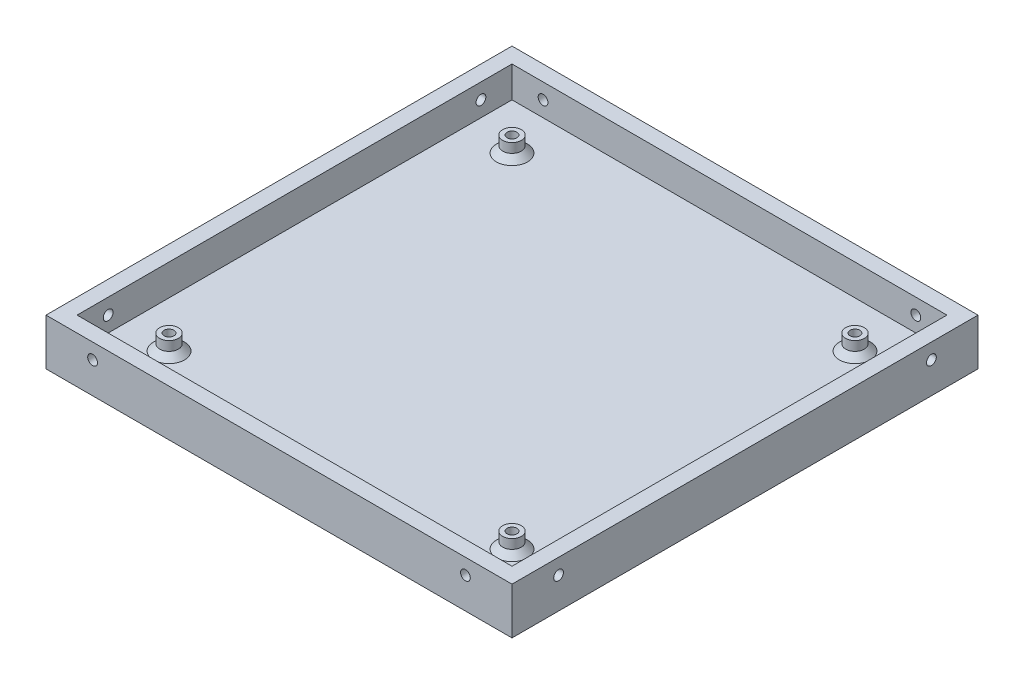
ISO-10303-21;
HEADER;
FILE_DESCRIPTION(('STEP AP214'),'2;1');
FILE_NAME('part.step','',(''),(''),'','','');
FILE_SCHEMA(('AUTOMOTIVE_DESIGN { 1 0 10303 214 1 1 1 1 }'));
ENDSEC;
DATA;
#1=APPLICATION_CONTEXT('core data for automotive mechanical design processes');
#2=APPLICATION_PROTOCOL_DEFINITION('international standard','automotive_design',2000,#1);
#3=PRODUCT_CONTEXT('',#1,'mechanical');
#4=PRODUCT('Part','Part','',(#3));
#5=PRODUCT_RELATED_PRODUCT_CATEGORY('part','',(#4));
#6=PRODUCT_DEFINITION_FORMATION('','',#4);
#7=PRODUCT_DEFINITION_CONTEXT('part definition',#1,'design');
#8=PRODUCT_DEFINITION('design','',#6,#7);
#9=PRODUCT_DEFINITION_SHAPE('','',#8);
#10=(LENGTH_UNIT() NAMED_UNIT(*) SI_UNIT(.MILLI.,.METRE.));
#11=(NAMED_UNIT(*) PLANE_ANGLE_UNIT() SI_UNIT($,.RADIAN.));
#12=(NAMED_UNIT(*) SI_UNIT($,.STERADIAN.) SOLID_ANGLE_UNIT());
#13=UNCERTAINTY_MEASURE_WITH_UNIT(LENGTH_MEASURE(1.E-05),#10,'distance_accuracy_value','');
#14=(GEOMETRIC_REPRESENTATION_CONTEXT(3) GLOBAL_UNCERTAINTY_ASSIGNED_CONTEXT((#13)) GLOBAL_UNIT_ASSIGNED_CONTEXT((#10,
#11,#12)) REPRESENTATION_CONTEXT('',''));
#15=CARTESIAN_POINT('',(0.,0.,0.));
#16=DIRECTION('',(0.,0.,1.));
#17=DIRECTION('',(1.,0.,0.));
#18=AXIS2_PLACEMENT_3D('',#15,#16,#17);
#19=CARTESIAN_POINT('',(0.,9.525,0.));
#20=DIRECTION('',(0.,1.,0.));
#21=DIRECTION('',(0.,0.,1.));
#22=AXIS2_PLACEMENT_3D('',#19,#20,#21);
#23=PLANE('',#22);
#24=DIRECTION('',(0.,0.,1.));
#25=VECTOR('',#24,1.);
#26=CARTESIAN_POINT('',(-47.625,9.525,-47.625));
#27=LINE('',#26,#25);
#28=CARTESIAN_POINT('',(-47.625,9.525,-47.625));
#29=VERTEX_POINT('',#28);
#30=CARTESIAN_POINT('',(-47.625,9.525,47.625));
#31=VERTEX_POINT('',#30);
#32=EDGE_CURVE('E72',#29,#31,#27,.T.);
#33=ORIENTED_EDGE('',*,*,#32,.T.);
#34=DIRECTION('',(1.,0.,0.));
#35=VECTOR('',#34,1.);
#36=CARTESIAN_POINT('',(-47.625,9.525,47.625));
#37=LINE('',#36,#35);
#38=CARTESIAN_POINT('',(47.625,9.525,47.625));
#39=VERTEX_POINT('',#38);
#40=EDGE_CURVE('E126',#31,#39,#37,.T.);
#41=ORIENTED_EDGE('',*,*,#40,.T.);
#42=DIRECTION('',(0.,0.,-1.));
#43=VECTOR('',#42,1.);
#44=CARTESIAN_POINT('',(47.625,9.525,-47.625));
#45=LINE('',#44,#43);
#46=CARTESIAN_POINT('',(47.625,9.525,-47.625));
#47=VERTEX_POINT('',#46);
#48=EDGE_CURVE('E133',#39,#47,#45,.T.);
#49=ORIENTED_EDGE('',*,*,#48,.T.);
#50=DIRECTION('',(-1.,0.,0.));
#51=VECTOR('',#50,1.);
#52=CARTESIAN_POINT('',(-47.625,9.525,-47.625));
#53=LINE('',#52,#51);
#54=EDGE_CURVE('E138',#47,#29,#53,.T.);
#55=ORIENTED_EDGE('',*,*,#54,.T.);
#56=EDGE_LOOP('',(#33,#41,#49,#55));
#57=FACE_BOUND('',#56,.T.);
#58=DIRECTION('',(1.,0.,0.));
#59=VECTOR('',#58,1.);
#60=CARTESIAN_POINT('',(-44.45,9.525,44.45));
#61=LINE('',#60,#59);
#62=CARTESIAN_POINT('',(-44.45,9.525,44.45));
#63=VERTEX_POINT('',#62);
#64=CARTESIAN_POINT('',(44.45,9.525,44.45));
#65=VERTEX_POINT('',#64);
#66=EDGE_CURVE('E223',#63,#65,#61,.T.);
#67=ORIENTED_EDGE('',*,*,#66,.F.);
#68=DIRECTION('',(0.,0.,1.));
#69=VECTOR('',#68,1.);
#70=CARTESIAN_POINT('',(-44.45,9.525,-44.45));
#71=LINE('',#70,#69);
#72=CARTESIAN_POINT('',(-44.45,9.525,-44.45));
#73=VERTEX_POINT('',#72);
#74=EDGE_CURVE('E220',#73,#63,#71,.T.);
#75=ORIENTED_EDGE('',*,*,#74,.F.);
#76=DIRECTION('',(-1.,0.,0.));
#77=VECTOR('',#76,1.);
#78=CARTESIAN_POINT('',(-44.45,9.525,-44.45));
#79=LINE('',#78,#77);
#80=CARTESIAN_POINT('',(44.45,9.525,-44.45));
#81=VERTEX_POINT('',#80);
#82=EDGE_CURVE('E231',#81,#73,#79,.T.);
#83=ORIENTED_EDGE('',*,*,#82,.F.);
#84=DIRECTION('',(0.,0.,-1.));
#85=VECTOR('',#84,1.);
#86=CARTESIAN_POINT('',(44.45,9.525,-44.45));
#87=LINE('',#86,#85);
#88=EDGE_CURVE('E227',#65,#81,#87,.T.);
#89=ORIENTED_EDGE('',*,*,#88,.F.);
#90=EDGE_LOOP('',(#67,#75,#83,#89));
#91=FACE_BOUND('',#90,.T.);
#92=ADVANCED_FACE('F47',(#57,#91),#23,.T.);
#93=CARTESIAN_POINT('',(-44.45,9.525,-44.45));
#94=DIRECTION('',(1.,0.,0.));
#95=DIRECTION('',(0.,0.,-1.));
#96=AXIS2_PLACEMENT_3D('',#93,#94,#95);
#97=PLANE('',#96);
#98=CARTESIAN_POINT('',(-44.4500000000001,6.35000000000005,38.0999999999998));
#99=DIRECTION('',(-1.,0.,0.));
#100=DIRECTION('',(0.,0.,-1.));
#101=AXIS2_PLACEMENT_3D('',#98,#99,#100);
#102=CIRCLE('',#101,0.99949);
#103=CARTESIAN_POINT('',(-44.4500000000001,6.35000000000005,37.1005099999998));
#104=VERTEX_POINT('',#103);
#105=EDGE_CURVE('E200',#104,#104,#102,.T.);
#106=ORIENTED_EDGE('',*,*,#105,.T.);
#107=EDGE_LOOP('',(#106));
#108=FACE_BOUND('',#107,.T.);
#109=CARTESIAN_POINT('',(-44.4499999999999,6.35,-38.1000000000002));
#110=DIRECTION('',(-1.,0.,0.));
#111=DIRECTION('',(0.,0.,1.));
#112=AXIS2_PLACEMENT_3D('',#109,#110,#111);
#113=CIRCLE('',#112,0.99949);
#114=CARTESIAN_POINT('',(-44.4499999999999,6.35,-37.1005100000001));
#115=VERTEX_POINT('',#114);
#116=EDGE_CURVE('E204',#115,#115,#113,.T.);
#117=ORIENTED_EDGE('',*,*,#116,.T.);
#118=EDGE_LOOP('',(#117));
#119=FACE_BOUND('',#118,.T.);
#120=DIRECTION('',(0.,0.,1.));
#121=VECTOR('',#120,1.);
#122=CARTESIAN_POINT('',(-44.45,3.175,-44.45));
#123=LINE('',#122,#121);
#124=CARTESIAN_POINT('',(-44.45,3.175,-44.45));
#125=VERTEX_POINT('',#124);
#126=CARTESIAN_POINT('',(-44.45,3.175,44.45));
#127=VERTEX_POINT('',#126);
#128=EDGE_CURVE('E216',#125,#127,#123,.T.);
#129=ORIENTED_EDGE('',*,*,#128,.F.);
#130=DIRECTION('',(0.,-1.,0.));
#131=VECTOR('',#130,1.);
#132=CARTESIAN_POINT('',(-44.45,9.525,-44.45));
#133=LINE('',#132,#131);
#134=EDGE_CURVE('E234',#73,#125,#133,.T.);
#135=ORIENTED_EDGE('',*,*,#134,.F.);
#136=ORIENTED_EDGE('',*,*,#74,.T.);
#137=DIRECTION('',(0.,-1.,0.));
#138=VECTOR('',#137,1.);
#139=CARTESIAN_POINT('',(-44.45,9.525,44.45));
#140=LINE('',#139,#138);
#141=EDGE_CURVE('E256',#63,#127,#140,.T.);
#142=ORIENTED_EDGE('',*,*,#141,.T.);
#143=EDGE_LOOP('',(#129,#135,#136,#142));
#144=FACE_BOUND('',#143,.T.);
#145=ADVANCED_FACE('F349',(#108,#119,#144),#97,.T.);
#146=CARTESIAN_POINT('',(-44.45,9.525,44.45));
#147=DIRECTION('',(0.,0.,-1.));
#148=DIRECTION('',(-1.,0.,0.));
#149=AXIS2_PLACEMENT_3D('',#146,#147,#148);
#150=PLANE('',#149);
#151=CARTESIAN_POINT('',(-38.1,6.35,44.45));
#152=DIRECTION('',(0.,0.,1.));
#153=DIRECTION('',(1.,0.,0.));
#154=AXIS2_PLACEMENT_3D('',#151,#152,#153);
#155=CIRCLE('',#154,0.99949);
#156=CARTESIAN_POINT('',(-37.10051,6.35,44.45));
#157=VERTEX_POINT('',#156);
#158=EDGE_CURVE('E212',#157,#157,#155,.T.);
#159=ORIENTED_EDGE('',*,*,#158,.T.);
#160=EDGE_LOOP('',(#159));
#161=FACE_BOUND('',#160,.T.);
#162=CARTESIAN_POINT('',(38.1,6.35000000000005,44.45));
#163=DIRECTION('',(0.,0.,1.));
#164=DIRECTION('',(-1.,0.,0.));
#165=AXIS2_PLACEMENT_3D('',#162,#163,#164);
#166=CIRCLE('',#165,0.99949);
#167=CARTESIAN_POINT('',(37.10051,6.35000000000005,44.45));
#168=VERTEX_POINT('',#167);
#169=EDGE_CURVE('E211',#168,#168,#166,.T.);
#170=ORIENTED_EDGE('',*,*,#169,.T.);
#171=EDGE_LOOP('',(#170));
#172=FACE_BOUND('',#171,.T.);
#173=DIRECTION('',(1.,0.,0.));
#174=VECTOR('',#173,1.);
#175=CARTESIAN_POINT('',(-44.45,3.175,44.45));
#176=LINE('',#175,#174);
#177=CARTESIAN_POINT('',(44.45,3.175,44.45));
#178=VERTEX_POINT('',#177);
#179=EDGE_CURVE('E237',#127,#178,#176,.T.);
#180=ORIENTED_EDGE('',*,*,#179,.F.);
#181=ORIENTED_EDGE('',*,*,#141,.F.);
#182=ORIENTED_EDGE('',*,*,#66,.T.);
#183=DIRECTION('',(0.,-1.,0.));
#184=VECTOR('',#183,1.);
#185=CARTESIAN_POINT('',(44.45,9.525,44.45));
#186=LINE('',#185,#184);
#187=EDGE_CURVE('E252',#65,#178,#186,.T.);
#188=ORIENTED_EDGE('',*,*,#187,.T.);
#189=EDGE_LOOP('',(#180,#181,#182,#188));
#190=FACE_BOUND('',#189,.T.);
#191=ADVANCED_FACE('F356',(#161,#172,#190),#150,.T.);
#192=CARTESIAN_POINT('',(44.45,9.525,-44.45));
#193=DIRECTION('',(-1.,0.,0.));
#194=DIRECTION('',(0.,0.,1.));
#195=AXIS2_PLACEMENT_3D('',#192,#193,#194);
#196=PLANE('',#195);
#197=CARTESIAN_POINT('',(44.4499999999996,6.35,38.1000000000005));
#198=DIRECTION('',(1.,0.,0.));
#199=DIRECTION('',(0.,0.,-1.));
#200=AXIS2_PLACEMENT_3D('',#197,#198,#199);
#201=CIRCLE('',#200,0.99949);
#202=CARTESIAN_POINT('',(44.4499999999996,6.35,37.1005100000005));
#203=VERTEX_POINT('',#202);
#204=EDGE_CURVE('E191',#203,#203,#201,.T.);
#205=ORIENTED_EDGE('',*,*,#204,.T.);
#206=EDGE_LOOP('',(#205));
#207=FACE_BOUND('',#206,.T.);
#208=CARTESIAN_POINT('',(44.4500000000004,6.35000000000005,-38.0999999999995));
#209=DIRECTION('',(1.,0.,0.));
#210=DIRECTION('',(0.,0.,1.));
#211=AXIS2_PLACEMENT_3D('',#208,#209,#210);
#212=CIRCLE('',#211,0.99949);
#213=CARTESIAN_POINT('',(44.4500000000004,6.35000000000005,-37.1005099999995));
#214=VERTEX_POINT('',#213);
#215=EDGE_CURVE('E187',#214,#214,#212,.T.);
#216=ORIENTED_EDGE('',*,*,#215,.T.);
#217=EDGE_LOOP('',(#216));
#218=FACE_BOUND('',#217,.T.);
#219=DIRECTION('',(0.,0.,-1.));
#220=VECTOR('',#219,1.);
#221=CARTESIAN_POINT('',(44.45,3.175,-44.45));
#222=LINE('',#221,#220);
#223=CARTESIAN_POINT('',(44.45,3.175,-44.45));
#224=VERTEX_POINT('',#223);
#225=EDGE_CURVE('E240',#178,#224,#222,.T.);
#226=ORIENTED_EDGE('',*,*,#225,.F.);
#227=ORIENTED_EDGE('',*,*,#187,.F.);
#228=ORIENTED_EDGE('',*,*,#88,.T.);
#229=DIRECTION('',(0.,-1.,0.));
#230=VECTOR('',#229,1.);
#231=CARTESIAN_POINT('',(44.45,9.525,-44.45));
#232=LINE('',#231,#230);
#233=EDGE_CURVE('E248',#81,#224,#232,.T.);
#234=ORIENTED_EDGE('',*,*,#233,.T.);
#235=EDGE_LOOP('',(#226,#227,#228,#234));
#236=FACE_BOUND('',#235,.T.);
#237=ADVANCED_FACE('F511',(#207,#218,#236),#196,.T.);
#238=CARTESIAN_POINT('',(-44.45,9.525,-44.45));
#239=DIRECTION('',(0.,0.,1.));
#240=DIRECTION('',(1.,0.,0.));
#241=AXIS2_PLACEMENT_3D('',#238,#239,#240);
#242=PLANE('',#241);
#243=CARTESIAN_POINT('',(-38.1,6.35000000000005,-44.45));
#244=DIRECTION('',(0.,0.,-1.));
#245=DIRECTION('',(1.,0.,0.));
#246=AXIS2_PLACEMENT_3D('',#243,#244,#245);
#247=CIRCLE('',#246,0.99949);
#248=CARTESIAN_POINT('',(-37.10051,6.35000000000005,-44.45));
#249=VERTEX_POINT('',#248);
#250=EDGE_CURVE('E192',#249,#249,#247,.T.);
#251=ORIENTED_EDGE('',*,*,#250,.T.);
#252=EDGE_LOOP('',(#251));
#253=FACE_BOUND('',#252,.T.);
#254=CARTESIAN_POINT('',(38.1,6.35,-44.45));
#255=DIRECTION('',(0.,0.,-1.));
#256=DIRECTION('',(-1.,0.,0.));
#257=AXIS2_PLACEMENT_3D('',#254,#255,#256);
#258=CIRCLE('',#257,0.99949);
#259=CARTESIAN_POINT('',(37.10051,6.35,-44.45));
#260=VERTEX_POINT('',#259);
#261=EDGE_CURVE('E196',#260,#260,#258,.T.);
#262=ORIENTED_EDGE('',*,*,#261,.T.);
#263=EDGE_LOOP('',(#262));
#264=FACE_BOUND('',#263,.T.);
#265=DIRECTION('',(-1.,0.,0.));
#266=VECTOR('',#265,1.);
#267=CARTESIAN_POINT('',(-44.45,3.175,-44.45));
#268=LINE('',#267,#266);
#269=EDGE_CURVE('E224',#224,#125,#268,.T.);
#270=ORIENTED_EDGE('',*,*,#269,.F.);
#271=ORIENTED_EDGE('',*,*,#233,.F.);
#272=ORIENTED_EDGE('',*,*,#82,.T.);
#273=ORIENTED_EDGE('',*,*,#134,.T.);
#274=EDGE_LOOP('',(#270,#271,#272,#273));
#275=FACE_BOUND('',#274,.T.);
#276=ADVANCED_FACE('F365',(#253,#264,#275),#242,.T.);
#277=CARTESIAN_POINT('',(0.,3.175,0.));
#278=DIRECTION('',(0.,1.,0.));
#279=DIRECTION('',(0.,0.,1.));
#280=AXIS2_PLACEMENT_3D('',#277,#278,#279);
#281=PLANE('',#280);
#282=CARTESIAN_POINT('',(35.0520000000001,3.175,35.052));
#283=DIRECTION('',(0.,1.,0.));
#284=DIRECTION('',(0.,0.,1.));
#285=AXIS2_PLACEMENT_3D('',#282,#283,#284);
#286=CIRCLE('',#285,3.175);
#287=CARTESIAN_POINT('',(35.0520000000001,3.175,38.227));
#288=VERTEX_POINT('',#287);
#289=EDGE_CURVE('E320',#288,#288,#286,.F.);
#290=ORIENTED_EDGE('',*,*,#289,.T.);
#291=EDGE_LOOP('',(#290));
#292=FACE_BOUND('',#291,.T.);
#293=CARTESIAN_POINT('',(-35.052,3.175,35.052));
#294=DIRECTION('',(0.,1.,0.));
#295=DIRECTION('',(0.,0.,1.));
#296=AXIS2_PLACEMENT_3D('',#293,#294,#295);
#297=CIRCLE('',#296,3.175);
#298=CARTESIAN_POINT('',(-35.052,3.175,38.227));
#299=VERTEX_POINT('',#298);
#300=EDGE_CURVE('E316',#299,#299,#297,.F.);
#301=ORIENTED_EDGE('',*,*,#300,.T.);
#302=EDGE_LOOP('',(#301));
#303=FACE_BOUND('',#302,.T.);
#304=CARTESIAN_POINT('',(35.0520000000001,3.175,-35.0519999999999));
#305=DIRECTION('',(0.,1.,0.));
#306=DIRECTION('',(0.,0.,1.));
#307=AXIS2_PLACEMENT_3D('',#304,#305,#306);
#308=CIRCLE('',#307,3.175);
#309=CARTESIAN_POINT('',(35.0520000000001,3.175,-31.8769999999999));
#310=VERTEX_POINT('',#309);
#311=EDGE_CURVE('E312',#310,#310,#308,.F.);
#312=ORIENTED_EDGE('',*,*,#311,.T.);
#313=EDGE_LOOP('',(#312));
#314=FACE_BOUND('',#313,.T.);
#315=CARTESIAN_POINT('',(-35.052,3.175,-35.052));
#316=DIRECTION('',(0.,1.,0.));
#317=DIRECTION('',(0.,0.,1.));
#318=AXIS2_PLACEMENT_3D('',#315,#316,#317);
#319=CIRCLE('',#318,3.175);
#320=CARTESIAN_POINT('',(-35.052,3.175,-31.877));
#321=VERTEX_POINT('',#320);
#322=EDGE_CURVE('E308',#321,#321,#319,.F.);
#323=ORIENTED_EDGE('',*,*,#322,.T.);
#324=EDGE_LOOP('',(#323));
#325=FACE_BOUND('',#324,.T.);
#326=ORIENTED_EDGE('',*,*,#128,.T.);
#327=ORIENTED_EDGE('',*,*,#179,.T.);
#328=ORIENTED_EDGE('',*,*,#225,.T.);
#329=ORIENTED_EDGE('',*,*,#269,.T.);
#330=EDGE_LOOP('',(#326,#327,#328,#329));
#331=FACE_BOUND('',#330,.T.);
#332=ADVANCED_FACE('F361',(#292,#303,#314,#325,#331),#281,.T.);
#333=CARTESIAN_POINT('',(38.1,6.35000000000005,44.45));
#334=DIRECTION('',(0.,0.,1.));
#335=DIRECTION('',(1.,0.,0.));
#336=AXIS2_PLACEMENT_3D('',#333,#334,#335);
#337=CYLINDRICAL_SURFACE('',#336,0.99949);
#338=CARTESIAN_POINT('',(38.1,6.35000000000005,47.625));
#339=DIRECTION('',(0.,0.,-1.));
#340=DIRECTION('',(-1.,0.,0.));
#341=AXIS2_PLACEMENT_3D('',#338,#339,#340);
#342=CIRCLE('',#341,0.99949);
#343=CARTESIAN_POINT('',(37.10051,6.35000000000005,47.625));
#344=VERTEX_POINT('',#343);
#345=EDGE_CURVE('E183',#344,#344,#342,.F.);
#346=ORIENTED_EDGE('',*,*,#345,.T.);
#347=EDGE_LOOP('',(#346));
#348=FACE_BOUND('',#347,.T.);
#349=ORIENTED_EDGE('',*,*,#169,.F.);
#350=EDGE_LOOP('',(#349));
#351=FACE_BOUND('',#350,.T.);
#352=ADVANCED_FACE('F364',(#348,#351),#337,.F.);
#353=CARTESIAN_POINT('',(-38.1,6.35,44.45));
#354=DIRECTION('',(0.,0.,1.));
#355=DIRECTION('',(1.,0.,0.));
#356=AXIS2_PLACEMENT_3D('',#353,#354,#355);
#357=CYLINDRICAL_SURFACE('',#356,0.99949);
#358=CARTESIAN_POINT('',(-38.1,6.35,47.625));
#359=DIRECTION('',(0.,0.,-1.));
#360=DIRECTION('',(-1.,0.,0.));
#361=AXIS2_PLACEMENT_3D('',#358,#359,#360);
#362=CIRCLE('',#361,0.99949);
#363=CARTESIAN_POINT('',(-39.09949,6.35,47.625));
#364=VERTEX_POINT('',#363);
#365=EDGE_CURVE('E182',#364,#364,#362,.F.);
#366=ORIENTED_EDGE('',*,*,#365,.T.);
#367=EDGE_LOOP('',(#366));
#368=FACE_BOUND('',#367,.T.);
#369=ORIENTED_EDGE('',*,*,#158,.F.);
#370=EDGE_LOOP('',(#369));
#371=FACE_BOUND('',#370,.T.);
#372=ADVANCED_FACE('F500',(#368,#371),#357,.F.);
#373=CARTESIAN_POINT('',(38.1,6.35,-44.45));
#374=DIRECTION('',(0.,0.,-1.));
#375=DIRECTION('',(-1.,0.,0.));
#376=AXIS2_PLACEMENT_3D('',#373,#374,#375);
#377=CYLINDRICAL_SURFACE('',#376,0.99949);
#378=CARTESIAN_POINT('',(38.1,6.35,-47.625));
#379=DIRECTION('',(0.,0.,1.));
#380=DIRECTION('',(1.,0.,0.));
#381=AXIS2_PLACEMENT_3D('',#378,#379,#380);
#382=CIRCLE('',#381,0.99949);
#383=CARTESIAN_POINT('',(39.09949,6.35,-47.625));
#384=VERTEX_POINT('',#383);
#385=EDGE_CURVE('E178',#384,#384,#382,.F.);
#386=ORIENTED_EDGE('',*,*,#385,.T.);
#387=EDGE_LOOP('',(#386));
#388=FACE_BOUND('',#387,.T.);
#389=ORIENTED_EDGE('',*,*,#261,.F.);
#390=EDGE_LOOP('',(#389));
#391=FACE_BOUND('',#390,.T.);
#392=ADVANCED_FACE('F489',(#388,#391),#377,.F.);
#393=CARTESIAN_POINT('',(-38.1,6.35000000000005,-44.45));
#394=DIRECTION('',(0.,0.,-1.));
#395=DIRECTION('',(-1.,0.,0.));
#396=AXIS2_PLACEMENT_3D('',#393,#394,#395);
#397=CYLINDRICAL_SURFACE('',#396,0.99949);
#398=CARTESIAN_POINT('',(-38.1,6.35000000000005,-47.625));
#399=DIRECTION('',(0.,0.,1.));
#400=DIRECTION('',(1.,0.,0.));
#401=AXIS2_PLACEMENT_3D('',#398,#399,#400);
#402=CIRCLE('',#401,0.99949);
#403=CARTESIAN_POINT('',(-37.10051,6.35000000000005,-47.625));
#404=VERTEX_POINT('',#403);
#405=EDGE_CURVE('E177',#404,#404,#402,.F.);
#406=ORIENTED_EDGE('',*,*,#405,.T.);
#407=EDGE_LOOP('',(#406));
#408=FACE_BOUND('',#407,.T.);
#409=ORIENTED_EDGE('',*,*,#250,.F.);
#410=EDGE_LOOP('',(#409));
#411=FACE_BOUND('',#410,.T.);
#412=ADVANCED_FACE('F485',(#408,#411),#397,.F.);
#413=CARTESIAN_POINT('',(44.4500000000004,6.35000000000005,-38.0999999999995));
#414=DIRECTION('',(1.,0.,0.));
#415=DIRECTION('',(0.,0.,-1.));
#416=AXIS2_PLACEMENT_3D('',#413,#414,#415);
#417=CYLINDRICAL_SURFACE('',#416,0.99949);
#418=CARTESIAN_POINT('',(47.625,6.35000000000005,-38.0999999999995));
#419=DIRECTION('',(-1.,0.,0.));
#420=DIRECTION('',(0.,0.,1.));
#421=AXIS2_PLACEMENT_3D('',#418,#419,#420);
#422=CIRCLE('',#421,0.99949);
#423=CARTESIAN_POINT('',(47.625,6.35000000000005,-37.1005099999995));
#424=VERTEX_POINT('',#423);
#425=EDGE_CURVE('E173',#424,#424,#422,.F.);
#426=ORIENTED_EDGE('',*,*,#425,.T.);
#427=EDGE_LOOP('',(#426));
#428=FACE_BOUND('',#427,.T.);
#429=ORIENTED_EDGE('',*,*,#215,.F.);
#430=EDGE_LOOP('',(#429));
#431=FACE_BOUND('',#430,.T.);
#432=ADVANCED_FACE('F481',(#428,#431),#417,.F.);
#433=CARTESIAN_POINT('',(44.4499999999996,6.35,38.1000000000005));
#434=DIRECTION('',(1.,0.,0.));
#435=DIRECTION('',(0.,0.,-1.));
#436=AXIS2_PLACEMENT_3D('',#433,#434,#435);
#437=CYLINDRICAL_SURFACE('',#436,0.99949);
#438=CARTESIAN_POINT('',(47.625,6.35,38.1000000000005));
#439=DIRECTION('',(-1.,0.,0.));
#440=DIRECTION('',(0.,0.,1.));
#441=AXIS2_PLACEMENT_3D('',#438,#439,#440);
#442=CIRCLE('',#441,0.99949);
#443=CARTESIAN_POINT('',(47.625,6.35,39.0994900000005));
#444=VERTEX_POINT('',#443);
#445=EDGE_CURVE('E172',#444,#444,#442,.F.);
#446=ORIENTED_EDGE('',*,*,#445,.T.);
#447=EDGE_LOOP('',(#446));
#448=FACE_BOUND('',#447,.T.);
#449=ORIENTED_EDGE('',*,*,#204,.F.);
#450=EDGE_LOOP('',(#449));
#451=FACE_BOUND('',#450,.T.);
#452=ADVANCED_FACE('F484',(#448,#451),#437,.F.);
#453=CARTESIAN_POINT('',(-44.4499999999999,6.35,-38.1000000000002));
#454=DIRECTION('',(-1.,0.,0.));
#455=DIRECTION('',(0.,0.,1.));
#456=AXIS2_PLACEMENT_3D('',#453,#454,#455);
#457=CYLINDRICAL_SURFACE('',#456,0.99949);
#458=CARTESIAN_POINT('',(-47.625,6.35,-38.1000000000002));
#459=DIRECTION('',(1.,0.,0.));
#460=DIRECTION('',(0.,0.,-1.));
#461=AXIS2_PLACEMENT_3D('',#458,#459,#460);
#462=CIRCLE('',#461,0.99949);
#463=CARTESIAN_POINT('',(-47.625,6.35,-39.0994900000002));
#464=VERTEX_POINT('',#463);
#465=EDGE_CURVE('E168',#464,#464,#462,.F.);
#466=ORIENTED_EDGE('',*,*,#465,.T.);
#467=EDGE_LOOP('',(#466));
#468=FACE_BOUND('',#467,.T.);
#469=ORIENTED_EDGE('',*,*,#116,.F.);
#470=EDGE_LOOP('',(#469));
#471=FACE_BOUND('',#470,.T.);
#472=ADVANCED_FACE('F493',(#468,#471),#457,.F.);
#473=CARTESIAN_POINT('',(-44.4500000000001,6.35000000000005,38.0999999999998));
#474=DIRECTION('',(-1.,0.,0.));
#475=DIRECTION('',(0.,0.,1.));
#476=AXIS2_PLACEMENT_3D('',#473,#474,#475);
#477=CYLINDRICAL_SURFACE('',#476,0.99949);
#478=CARTESIAN_POINT('',(-47.625,6.35000000000005,38.0999999999998));
#479=DIRECTION('',(1.,0.,0.));
#480=DIRECTION('',(0.,0.,-1.));
#481=AXIS2_PLACEMENT_3D('',#478,#479,#480);
#482=CIRCLE('',#481,0.99949);
#483=CARTESIAN_POINT('',(-47.625,6.35000000000005,37.1005099999998));
#484=VERTEX_POINT('',#483);
#485=EDGE_CURVE('E122',#484,#484,#482,.F.);
#486=ORIENTED_EDGE('',*,*,#485,.T.);
#487=EDGE_LOOP('',(#486));
#488=FACE_BOUND('',#487,.T.);
#489=ORIENTED_EDGE('',*,*,#105,.F.);
#490=EDGE_LOOP('',(#489));
#491=FACE_BOUND('',#490,.T.);
#492=ADVANCED_FACE('F476',(#488,#491),#477,.F.);
#493=CARTESIAN_POINT('',(-47.625,9.525,47.625));
#494=DIRECTION('',(0.,0.,-1.));
#495=DIRECTION('',(-1.,0.,0.));
#496=AXIS2_PLACEMENT_3D('',#493,#494,#495);
#497=PLANE('',#496);
#498=ORIENTED_EDGE('',*,*,#365,.F.);
#499=EDGE_LOOP('',(#498));
#500=FACE_BOUND('',#499,.T.);
#501=DIRECTION('',(1.,0.,0.));
#502=VECTOR('',#501,1.);
#503=CARTESIAN_POINT('',(-47.625,0.,47.625));
#504=LINE('',#503,#502);
#505=CARTESIAN_POINT('',(-47.625,0.,47.625));
#506=VERTEX_POINT('',#505);
#507=CARTESIAN_POINT('',(47.625,0.,47.625));
#508=VERTEX_POINT('',#507);
#509=EDGE_CURVE('E156',#506,#508,#504,.T.);
#510=ORIENTED_EDGE('',*,*,#509,.T.);
#511=DIRECTION('',(0.,-1.,0.));
#512=VECTOR('',#511,1.);
#513=CARTESIAN_POINT('',(47.625,9.525,47.625));
#514=LINE('',#513,#512);
#515=EDGE_CURVE('E123',#39,#508,#514,.T.);
#516=ORIENTED_EDGE('',*,*,#515,.F.);
#517=ORIENTED_EDGE('',*,*,#40,.F.);
#518=DIRECTION('',(0.,-1.,0.));
#519=VECTOR('',#518,1.);
#520=CARTESIAN_POINT('',(-47.625,9.525,47.625));
#521=LINE('',#520,#519);
#522=EDGE_CURVE('E112',#31,#506,#521,.T.);
#523=ORIENTED_EDGE('',*,*,#522,.T.);
#524=EDGE_LOOP('',(#510,#516,#517,#523));
#525=FACE_BOUND('',#524,.T.);
#526=ORIENTED_EDGE('',*,*,#345,.F.);
#527=EDGE_LOOP('',(#526));
#528=FACE_BOUND('',#527,.T.);
#529=ADVANCED_FACE('F127',(#500,#525,#528),#497,.F.);
#530=CARTESIAN_POINT('',(-47.625,9.525,-47.625));
#531=DIRECTION('',(0.,0.,1.));
#532=DIRECTION('',(1.,0.,0.));
#533=AXIS2_PLACEMENT_3D('',#530,#531,#532);
#534=PLANE('',#533);
#535=ORIENTED_EDGE('',*,*,#405,.F.);
#536=EDGE_LOOP('',(#535));
#537=FACE_BOUND('',#536,.T.);
#538=DIRECTION('',(-1.,0.,0.));
#539=VECTOR('',#538,1.);
#540=CARTESIAN_POINT('',(-47.625,0.,-47.625));
#541=LINE('',#540,#539);
#542=CARTESIAN_POINT('',(47.625,0.,-47.625));
#543=VERTEX_POINT('',#542);
#544=CARTESIAN_POINT('',(-47.625,0.,-47.625));
#545=VERTEX_POINT('',#544);
#546=EDGE_CURVE('E140',#543,#545,#541,.T.);
#547=ORIENTED_EDGE('',*,*,#546,.T.);
#548=DIRECTION('',(0.,-1.,0.));
#549=VECTOR('',#548,1.);
#550=CARTESIAN_POINT('',(-47.625,9.525,-47.625));
#551=LINE('',#550,#549);
#552=EDGE_CURVE('E153',#29,#545,#551,.T.);
#553=ORIENTED_EDGE('',*,*,#552,.F.);
#554=ORIENTED_EDGE('',*,*,#54,.F.);
#555=DIRECTION('',(0.,-1.,0.));
#556=VECTOR('',#555,1.);
#557=CARTESIAN_POINT('',(47.625,9.525,-47.625));
#558=LINE('',#557,#556);
#559=EDGE_CURVE('E163',#47,#543,#558,.T.);
#560=ORIENTED_EDGE('',*,*,#559,.T.);
#561=EDGE_LOOP('',(#547,#553,#554,#560));
#562=FACE_BOUND('',#561,.T.);
#563=ORIENTED_EDGE('',*,*,#385,.F.);
#564=EDGE_LOOP('',(#563));
#565=FACE_BOUND('',#564,.T.);
#566=ADVANCED_FACE('F466',(#537,#562,#565),#534,.F.);
#567=CARTESIAN_POINT('',(47.625,9.525,-47.625));
#568=DIRECTION('',(-1.,0.,0.));
#569=DIRECTION('',(0.,0.,1.));
#570=AXIS2_PLACEMENT_3D('',#567,#568,#569);
#571=PLANE('',#570);
#572=ORIENTED_EDGE('',*,*,#445,.F.);
#573=EDGE_LOOP('',(#572));
#574=FACE_BOUND('',#573,.T.);
#575=DIRECTION('',(0.,0.,-1.));
#576=VECTOR('',#575,1.);
#577=CARTESIAN_POINT('',(47.625,0.,-47.625));
#578=LINE('',#577,#576);
#579=EDGE_CURVE('E64',#508,#543,#578,.T.);
#580=ORIENTED_EDGE('',*,*,#579,.T.);
#581=ORIENTED_EDGE('',*,*,#559,.F.);
#582=ORIENTED_EDGE('',*,*,#48,.F.);
#583=ORIENTED_EDGE('',*,*,#515,.T.);
#584=EDGE_LOOP('',(#580,#581,#582,#583));
#585=FACE_BOUND('',#584,.T.);
#586=ORIENTED_EDGE('',*,*,#425,.F.);
#587=EDGE_LOOP('',(#586));
#588=FACE_BOUND('',#587,.T.);
#589=ADVANCED_FACE('F469',(#574,#585,#588),#571,.F.);
#590=CARTESIAN_POINT('',(-47.625,9.525,-47.625));
#591=DIRECTION('',(1.,0.,0.));
#592=DIRECTION('',(0.,0.,-1.));
#593=AXIS2_PLACEMENT_3D('',#590,#591,#592);
#594=PLANE('',#593);
#595=ORIENTED_EDGE('',*,*,#485,.F.);
#596=EDGE_LOOP('',(#595));
#597=FACE_BOUND('',#596,.T.);
#598=DIRECTION('',(0.,0.,1.));
#599=VECTOR('',#598,1.);
#600=CARTESIAN_POINT('',(-47.625,0.,-47.625));
#601=LINE('',#600,#599);
#602=EDGE_CURVE('E117',#545,#506,#601,.T.);
#603=ORIENTED_EDGE('',*,*,#602,.T.);
#604=ORIENTED_EDGE('',*,*,#522,.F.);
#605=ORIENTED_EDGE('',*,*,#32,.F.);
#606=ORIENTED_EDGE('',*,*,#552,.T.);
#607=EDGE_LOOP('',(#603,#604,#605,#606));
#608=FACE_BOUND('',#607,.T.);
#609=ORIENTED_EDGE('',*,*,#465,.F.);
#610=EDGE_LOOP('',(#609));
#611=FACE_BOUND('',#610,.T.);
#612=ADVANCED_FACE('F114',(#597,#608,#611),#594,.F.);
#613=CARTESIAN_POINT('',(0.,0.,0.));
#614=DIRECTION('',(0.,1.,0.));
#615=DIRECTION('',(0.,0.,1.));
#616=AXIS2_PLACEMENT_3D('',#613,#614,#615);
#617=PLANE('',#616);
#618=CARTESIAN_POINT('',(-35.052,0.,-35.052));
#619=DIRECTION('',(0.,1.,0.));
#620=DIRECTION('',(0.,0.,1.));
#621=AXIS2_PLACEMENT_3D('',#618,#619,#620);
#622=CIRCLE('',#621,2.26948999999999);
#623=CARTESIAN_POINT('',(-35.052,0.,-32.78251));
#624=VERTEX_POINT('',#623);
#625=EDGE_CURVE('E284',#624,#624,#622,.T.);
#626=ORIENTED_EDGE('',*,*,#625,.T.);
#627=EDGE_LOOP('',(#626));
#628=FACE_BOUND('',#627,.T.);
#629=CARTESIAN_POINT('',(-35.052,0.,35.052));
#630=DIRECTION('',(0.,1.,0.));
#631=DIRECTION('',(0.,0.,1.));
#632=AXIS2_PLACEMENT_3D('',#629,#630,#631);
#633=CIRCLE('',#632,2.26948999999999);
#634=CARTESIAN_POINT('',(-35.052,0.,37.32149));
#635=VERTEX_POINT('',#634);
#636=EDGE_CURVE('E280',#635,#635,#633,.T.);
#637=ORIENTED_EDGE('',*,*,#636,.T.);
#638=EDGE_LOOP('',(#637));
#639=FACE_BOUND('',#638,.T.);
#640=CARTESIAN_POINT('',(35.0520000000001,0.,35.052));
#641=DIRECTION('',(0.,1.,0.));
#642=DIRECTION('',(0.,0.,1.));
#643=AXIS2_PLACEMENT_3D('',#640,#641,#642);
#644=CIRCLE('',#643,2.26948999999999);
#645=CARTESIAN_POINT('',(35.0520000000001,0.,37.32149));
#646=VERTEX_POINT('',#645);
#647=EDGE_CURVE('E276',#646,#646,#644,.T.);
#648=ORIENTED_EDGE('',*,*,#647,.T.);
#649=EDGE_LOOP('',(#648));
#650=FACE_BOUND('',#649,.T.);
#651=CARTESIAN_POINT('',(35.0520000000001,0.,-35.0519999999999));
#652=DIRECTION('',(0.,1.,0.));
#653=DIRECTION('',(0.,0.,1.));
#654=AXIS2_PLACEMENT_3D('',#651,#652,#653);
#655=CIRCLE('',#654,2.26948999999999);
#656=CARTESIAN_POINT('',(35.0520000000001,0.,-32.78251));
#657=VERTEX_POINT('',#656);
#658=EDGE_CURVE('E260',#657,#657,#655,.T.);
#659=ORIENTED_EDGE('',*,*,#658,.T.);
#660=EDGE_LOOP('',(#659));
#661=FACE_BOUND('',#660,.T.);
#662=ORIENTED_EDGE('',*,*,#509,.F.);
#663=ORIENTED_EDGE('',*,*,#602,.F.);
#664=ORIENTED_EDGE('',*,*,#546,.F.);
#665=ORIENTED_EDGE('',*,*,#579,.F.);
#666=EDGE_LOOP('',(#662,#663,#664,#665));
#667=FACE_BOUND('',#666,.T.);
#668=ADVANCED_FACE('F367',(#628,#639,#650,#661,#667),#617,.F.);
#669=CARTESIAN_POINT('',(-35.052,6.35,35.052));
#670=DIRECTION('',(0.,1.,0.));
#671=DIRECTION('',(0.,0.,1.));
#672=AXIS2_PLACEMENT_3D('',#669,#670,#671);
#673=PLANE('',#672);
#674=CARTESIAN_POINT('',(-35.052,6.35,35.052));
#675=DIRECTION('',(0.,1.,0.));
#676=DIRECTION('',(0.,0.,1.));
#677=AXIS2_PLACEMENT_3D('',#674,#675,#676);
#678=CIRCLE('',#677,1.905);
#679=CARTESIAN_POINT('',(-35.052,6.35,36.957));
#680=VERTEX_POINT('',#679);
#681=EDGE_CURVE('E146',#680,#680,#678,.T.);
#682=ORIENTED_EDGE('',*,*,#681,.T.);
#683=EDGE_LOOP('',(#682));
#684=FACE_BOUND('',#683,.T.);
#685=CARTESIAN_POINT('',(-35.052,6.35,35.052));
#686=DIRECTION('',(0.,1.,0.));
#687=DIRECTION('',(0.,0.,1.));
#688=AXIS2_PLACEMENT_3D('',#685,#686,#687);
#689=CIRCLE('',#688,0.999490000000001);
#690=CARTESIAN_POINT('',(-35.052,6.35,36.05149));
#691=VERTEX_POINT('',#690);
#692=EDGE_CURVE('E437',#691,#691,#689,.T.);
#693=ORIENTED_EDGE('',*,*,#692,.F.);
#694=EDGE_LOOP('',(#693));
#695=FACE_BOUND('',#694,.T.);
#696=ADVANCED_FACE('F370',(#684,#695),#673,.T.);
#697=CARTESIAN_POINT('',(-35.052,6.35,35.052));
#698=DIRECTION('',(0.,-1.,0.));
#699=DIRECTION('',(0.,0.,-1.));
#700=AXIS2_PLACEMENT_3D('',#697,#698,#699);
#701=CYLINDRICAL_SURFACE('',#700,1.905);
#702=CARTESIAN_POINT('',(-35.052,4.44500000000001,35.052));
#703=DIRECTION('',(0.,1.,0.));
#704=DIRECTION('',(0.,0.,1.));
#705=AXIS2_PLACEMENT_3D('',#702,#703,#704);
#706=CIRCLE('',#705,1.905);
#707=CARTESIAN_POINT('',(-35.052,4.44500000000001,36.957));
#708=VERTEX_POINT('',#707);
#709=EDGE_CURVE('E324',#708,#708,#706,.T.);
#710=ORIENTED_EDGE('',*,*,#709,.T.);
#711=EDGE_LOOP('',(#710));
#712=FACE_BOUND('',#711,.T.);
#713=ORIENTED_EDGE('',*,*,#681,.F.);
#714=EDGE_LOOP('',(#713));
#715=FACE_BOUND('',#714,.T.);
#716=ADVANCED_FACE('F453',(#712,#715),#701,.T.);
#717=CARTESIAN_POINT('',(-35.052,6.35,35.052));
#718=DIRECTION('',(0.,-1.,0.));
#719=DIRECTION('',(0.,0.,-1.));
#720=AXIS2_PLACEMENT_3D('',#717,#718,#719);
#721=CYLINDRICAL_SURFACE('',#720,0.999490000000001);
#722=CARTESIAN_POINT('',(-35.052,1.27,35.052));
#723=DIRECTION('',(0.,1.,0.));
#724=DIRECTION('',(0.,0.,1.));
#725=AXIS2_PLACEMENT_3D('',#722,#723,#724);
#726=CIRCLE('',#725,0.999490000000001);
#727=CARTESIAN_POINT('',(-35.052,1.27,36.05149));
#728=VERTEX_POINT('',#727);
#729=EDGE_CURVE('E292',#728,#728,#726,.F.);
#730=ORIENTED_EDGE('',*,*,#729,.T.);
#731=EDGE_LOOP('',(#730));
#732=FACE_BOUND('',#731,.T.);
#733=ORIENTED_EDGE('',*,*,#692,.T.);
#734=EDGE_LOOP('',(#733));
#735=FACE_BOUND('',#734,.T.);
#736=ADVANCED_FACE('F455',(#732,#735),#721,.F.);
#737=CARTESIAN_POINT('',(35.0520000000001,6.35,35.052));
#738=DIRECTION('',(0.,-1.,0.));
#739=DIRECTION('',(0.,0.,-1.));
#740=AXIS2_PLACEMENT_3D('',#737,#738,#739);
#741=PLANE('',#740);
#742=CARTESIAN_POINT('',(35.0520000000001,6.35,35.052));
#743=DIRECTION('',(0.,1.,0.));
#744=DIRECTION('',(0.,0.,-1.));
#745=AXIS2_PLACEMENT_3D('',#742,#743,#744);
#746=CIRCLE('',#745,1.905);
#747=CARTESIAN_POINT('',(35.0520000000001,6.35,33.147));
#748=VERTEX_POINT('',#747);
#749=EDGE_CURVE('E428',#748,#748,#746,.T.);
#750=ORIENTED_EDGE('',*,*,#749,.T.);
#751=EDGE_LOOP('',(#750));
#752=FACE_BOUND('',#751,.T.);
#753=CARTESIAN_POINT('',(35.0520000000001,6.35,35.052));
#754=DIRECTION('',(0.,1.,0.));
#755=DIRECTION('',(0.,0.,-1.));
#756=AXIS2_PLACEMENT_3D('',#753,#754,#755);
#757=CIRCLE('',#756,0.999490000000001);
#758=CARTESIAN_POINT('',(35.0520000000001,6.35,34.05251));
#759=VERTEX_POINT('',#758);
#760=EDGE_CURVE('E431',#759,#759,#757,.T.);
#761=ORIENTED_EDGE('',*,*,#760,.F.);
#762=EDGE_LOOP('',(#761));
#763=FACE_BOUND('',#762,.T.);
#764=ADVANCED_FACE('F424',(#752,#763),#741,.F.);
#765=CARTESIAN_POINT('',(35.0520000000001,6.35,35.052));
#766=DIRECTION('',(0.,-1.,0.));
#767=DIRECTION('',(0.,0.,-1.));
#768=AXIS2_PLACEMENT_3D('',#765,#766,#767);
#769=CYLINDRICAL_SURFACE('',#768,1.905);
#770=CARTESIAN_POINT('',(35.0520000000001,4.44500000000001,35.052));
#771=DIRECTION('',(0.,1.,0.));
#772=DIRECTION('',(0.,0.,1.));
#773=AXIS2_PLACEMENT_3D('',#770,#771,#772);
#774=CIRCLE('',#773,1.905);
#775=CARTESIAN_POINT('',(35.0520000000001,4.44500000000001,36.957));
#776=VERTEX_POINT('',#775);
#777=EDGE_CURVE('E304',#776,#776,#774,.T.);
#778=ORIENTED_EDGE('',*,*,#777,.T.);
#779=EDGE_LOOP('',(#778));
#780=FACE_BOUND('',#779,.T.);
#781=ORIENTED_EDGE('',*,*,#749,.F.);
#782=EDGE_LOOP('',(#781));
#783=FACE_BOUND('',#782,.T.);
#784=ADVANCED_FACE('F420',(#780,#783),#769,.T.);
#785=CARTESIAN_POINT('',(35.0520000000001,6.35,35.052));
#786=DIRECTION('',(0.,-1.,0.));
#787=DIRECTION('',(0.,0.,-1.));
#788=AXIS2_PLACEMENT_3D('',#785,#786,#787);
#789=CYLINDRICAL_SURFACE('',#788,0.999490000000001);
#790=CARTESIAN_POINT('',(35.0520000000001,1.27,35.052));
#791=DIRECTION('',(0.,1.,0.));
#792=DIRECTION('',(0.,0.,1.));
#793=AXIS2_PLACEMENT_3D('',#790,#791,#792);
#794=CIRCLE('',#793,0.999490000000001);
#795=CARTESIAN_POINT('',(35.0520000000001,1.27,36.05149));
#796=VERTEX_POINT('',#795);
#797=EDGE_CURVE('E296',#796,#796,#794,.F.);
#798=ORIENTED_EDGE('',*,*,#797,.T.);
#799=EDGE_LOOP('',(#798));
#800=FACE_BOUND('',#799,.T.);
#801=ORIENTED_EDGE('',*,*,#760,.T.);
#802=EDGE_LOOP('',(#801));
#803=FACE_BOUND('',#802,.T.);
#804=ADVANCED_FACE('F423',(#800,#803),#789,.F.);
#805=CARTESIAN_POINT('',(35.0520000000001,6.35,-35.0519999999999));
#806=DIRECTION('',(0.,1.,0.));
#807=DIRECTION('',(0.,0.,1.));
#808=AXIS2_PLACEMENT_3D('',#805,#806,#807);
#809=PLANE('',#808);
#810=CARTESIAN_POINT('',(35.0520000000001,6.35,-35.0519999999999));
#811=DIRECTION('',(0.,1.,0.));
#812=DIRECTION('',(0.,0.,1.));
#813=AXIS2_PLACEMENT_3D('',#810,#811,#812);
#814=CIRCLE('',#813,1.905);
#815=CARTESIAN_POINT('',(35.0520000000001,6.35,-33.1469999999999));
#816=VERTEX_POINT('',#815);
#817=EDGE_CURVE('E440',#816,#816,#814,.T.);
#818=ORIENTED_EDGE('',*,*,#817,.T.);
#819=EDGE_LOOP('',(#818));
#820=FACE_BOUND('',#819,.T.);
#821=CARTESIAN_POINT('',(35.0520000000001,6.35,-35.0519999999999));
#822=DIRECTION('',(0.,1.,0.));
#823=DIRECTION('',(0.,0.,1.));
#824=AXIS2_PLACEMENT_3D('',#821,#822,#823);
#825=CIRCLE('',#824,0.999490000000001);
#826=CARTESIAN_POINT('',(35.0520000000001,6.35,-34.0525099999999));
#827=VERTEX_POINT('',#826);
#828=EDGE_CURVE('E432',#827,#827,#825,.T.);
#829=ORIENTED_EDGE('',*,*,#828,.F.);
#830=EDGE_LOOP('',(#829));
#831=FACE_BOUND('',#830,.T.);
#832=ADVANCED_FACE('F673',(#820,#831),#809,.T.);
#833=CARTESIAN_POINT('',(35.0520000000001,6.35,-35.0519999999999));
#834=DIRECTION('',(0.,-1.,0.));
#835=DIRECTION('',(0.,0.,-1.));
#836=AXIS2_PLACEMENT_3D('',#833,#834,#835);
#837=CYLINDRICAL_SURFACE('',#836,1.905);
#838=CARTESIAN_POINT('',(35.0520000000001,4.44500000000001,-35.0519999999999));
#839=DIRECTION('',(0.,1.,0.));
#840=DIRECTION('',(0.,0.,1.));
#841=AXIS2_PLACEMENT_3D('',#838,#839,#840);
#842=CIRCLE('',#841,1.905);
#843=CARTESIAN_POINT('',(35.0520000000001,4.44500000000001,-33.1469999999999));
#844=VERTEX_POINT('',#843);
#845=EDGE_CURVE('E57',#844,#844,#842,.T.);
#846=ORIENTED_EDGE('',*,*,#845,.T.);
#847=EDGE_LOOP('',(#846));
#848=FACE_BOUND('',#847,.T.);
#849=ORIENTED_EDGE('',*,*,#817,.F.);
#850=EDGE_LOOP('',(#849));
#851=FACE_BOUND('',#850,.T.);
#852=ADVANCED_FACE('F331',(#848,#851),#837,.T.);
#853=CARTESIAN_POINT('',(35.0520000000001,6.35,-35.0519999999999));
#854=DIRECTION('',(0.,-1.,0.));
#855=DIRECTION('',(0.,0.,-1.));
#856=AXIS2_PLACEMENT_3D('',#853,#854,#855);
#857=CYLINDRICAL_SURFACE('',#856,0.999490000000001);
#858=CARTESIAN_POINT('',(35.0520000000001,1.27,-35.0519999999999));
#859=DIRECTION('',(0.,1.,0.));
#860=DIRECTION('',(0.,0.,1.));
#861=AXIS2_PLACEMENT_3D('',#858,#859,#860);
#862=CIRCLE('',#861,0.999490000000001);
#863=CARTESIAN_POINT('',(35.0520000000001,1.27,-34.0525099999999));
#864=VERTEX_POINT('',#863);
#865=EDGE_CURVE('E300',#864,#864,#862,.F.);
#866=ORIENTED_EDGE('',*,*,#865,.T.);
#867=EDGE_LOOP('',(#866));
#868=FACE_BOUND('',#867,.T.);
#869=ORIENTED_EDGE('',*,*,#828,.T.);
#870=EDGE_LOOP('',(#869));
#871=FACE_BOUND('',#870,.T.);
#872=ADVANCED_FACE('F693',(#868,#871),#857,.F.);
#873=CARTESIAN_POINT('',(-35.052,6.35,-35.052));
#874=DIRECTION('',(0.,-1.,0.));
#875=DIRECTION('',(0.,0.,-1.));
#876=AXIS2_PLACEMENT_3D('',#873,#874,#875);
#877=PLANE('',#876);
#878=CARTESIAN_POINT('',(-35.052,6.35,-35.052));
#879=DIRECTION('',(0.,1.,0.));
#880=DIRECTION('',(0.,0.,-1.));
#881=AXIS2_PLACEMENT_3D('',#878,#879,#880);
#882=CIRCLE('',#881,1.905);
#883=CARTESIAN_POINT('',(-35.052,6.35,-36.957));
#884=VERTEX_POINT('',#883);
#885=EDGE_CURVE('E808',#884,#884,#882,.T.);
#886=ORIENTED_EDGE('',*,*,#885,.T.);
#887=EDGE_LOOP('',(#886));
#888=FACE_BOUND('',#887,.T.);
#889=CARTESIAN_POINT('',(-35.052,6.35,-35.052));
#890=DIRECTION('',(0.,1.,0.));
#891=DIRECTION('',(0.,0.,-1.));
#892=AXIS2_PLACEMENT_3D('',#889,#890,#891);
#893=CIRCLE('',#892,0.999490000000001);
#894=CARTESIAN_POINT('',(-35.052,6.35,-36.05149));
#895=VERTEX_POINT('',#894);
#896=EDGE_CURVE('E805',#895,#895,#893,.T.);
#897=ORIENTED_EDGE('',*,*,#896,.F.);
#898=EDGE_LOOP('',(#897));
#899=FACE_BOUND('',#898,.T.);
#900=ADVANCED_FACE('F702',(#888,#899),#877,.F.);
#901=CARTESIAN_POINT('',(-35.052,6.35,-35.052));
#902=DIRECTION('',(0.,-1.,0.));
#903=DIRECTION('',(0.,0.,-1.));
#904=AXIS2_PLACEMENT_3D('',#901,#902,#903);
#905=CYLINDRICAL_SURFACE('',#904,1.905);
#906=CARTESIAN_POINT('',(-35.052,4.44500000000001,-35.052));
#907=DIRECTION('',(0.,1.,0.));
#908=DIRECTION('',(0.,0.,1.));
#909=AXIS2_PLACEMENT_3D('',#906,#907,#908);
#910=CIRCLE('',#909,1.905);
#911=CARTESIAN_POINT('',(-35.052,4.44500000000001,-33.147));
#912=VERTEX_POINT('',#911);
#913=EDGE_CURVE('E11',#912,#912,#910,.T.);
#914=ORIENTED_EDGE('',*,*,#913,.T.);
#915=EDGE_LOOP('',(#914));
#916=FACE_BOUND('',#915,.T.);
#917=ORIENTED_EDGE('',*,*,#885,.F.);
#918=EDGE_LOOP('',(#917));
#919=FACE_BOUND('',#918,.T.);
#920=ADVANCED_FACE('F713',(#916,#919),#905,.T.);
#921=CARTESIAN_POINT('',(-35.052,6.35,-35.052));
#922=DIRECTION('',(0.,-1.,0.));
#923=DIRECTION('',(0.,0.,-1.));
#924=AXIS2_PLACEMENT_3D('',#921,#922,#923);
#925=CYLINDRICAL_SURFACE('',#924,0.999490000000001);
#926=CARTESIAN_POINT('',(-35.052,1.27,-35.052));
#927=DIRECTION('',(0.,1.,0.));
#928=DIRECTION('',(0.,0.,1.));
#929=AXIS2_PLACEMENT_3D('',#926,#927,#928);
#930=CIRCLE('',#929,0.999490000000001);
#931=CARTESIAN_POINT('',(-35.052,1.27,-34.05251));
#932=VERTEX_POINT('',#931);
#933=EDGE_CURVE('E288',#932,#932,#930,.F.);
#934=ORIENTED_EDGE('',*,*,#933,.T.);
#935=EDGE_LOOP('',(#934));
#936=FACE_BOUND('',#935,.T.);
#937=ORIENTED_EDGE('',*,*,#896,.T.);
#938=EDGE_LOOP('',(#937));
#939=FACE_BOUND('',#938,.T.);
#940=ADVANCED_FACE('F380',(#936,#939),#925,.F.);
#941=CARTESIAN_POINT('',(-35.052,0.,-35.052));
#942=DIRECTION('',(0.,-1.,0.));
#943=DIRECTION('',(0.,0.,-1.));
#944=AXIS2_PLACEMENT_3D('',#941,#942,#943);
#945=CONICAL_SURFACE('',#944,2.26948999999999,0.785398163397441);
#946=ORIENTED_EDGE('',*,*,#933,.F.);
#947=EDGE_LOOP('',(#946));
#948=FACE_BOUND('',#947,.T.);
#949=ORIENTED_EDGE('',*,*,#625,.F.);
#950=EDGE_LOOP('',(#949));
#951=FACE_BOUND('',#950,.T.);
#952=ADVANCED_FACE('F373',(#948,#951),#945,.F.);
#953=CARTESIAN_POINT('',(-35.052,0.,35.052));
#954=DIRECTION('',(0.,-1.,0.));
#955=DIRECTION('',(0.,0.,-1.));
#956=AXIS2_PLACEMENT_3D('',#953,#954,#955);
#957=CONICAL_SURFACE('',#956,2.26948999999999,0.785398163397441);
#958=ORIENTED_EDGE('',*,*,#729,.F.);
#959=EDGE_LOOP('',(#958));
#960=FACE_BOUND('',#959,.T.);
#961=ORIENTED_EDGE('',*,*,#636,.F.);
#962=EDGE_LOOP('',(#961));
#963=FACE_BOUND('',#962,.T.);
#964=ADVANCED_FACE('F379',(#960,#963),#957,.F.);
#965=CARTESIAN_POINT('',(35.0520000000001,0.,35.052));
#966=DIRECTION('',(0.,-1.,0.));
#967=DIRECTION('',(0.,0.,-1.));
#968=AXIS2_PLACEMENT_3D('',#965,#966,#967);
#969=CONICAL_SURFACE('',#968,2.26948999999999,0.785398163397441);
#970=ORIENTED_EDGE('',*,*,#797,.F.);
#971=EDGE_LOOP('',(#970));
#972=FACE_BOUND('',#971,.T.);
#973=ORIENTED_EDGE('',*,*,#647,.F.);
#974=EDGE_LOOP('',(#973));
#975=FACE_BOUND('',#974,.T.);
#976=ADVANCED_FACE('F387',(#972,#975),#969,.F.);
#977=CARTESIAN_POINT('',(35.0520000000001,0.,-35.0519999999999));
#978=DIRECTION('',(0.,-1.,0.));
#979=DIRECTION('',(0.,0.,-1.));
#980=AXIS2_PLACEMENT_3D('',#977,#978,#979);
#981=CONICAL_SURFACE('',#980,2.26948999999999,0.785398163397441);
#982=ORIENTED_EDGE('',*,*,#865,.F.);
#983=EDGE_LOOP('',(#982));
#984=FACE_BOUND('',#983,.T.);
#985=ORIENTED_EDGE('',*,*,#658,.F.);
#986=EDGE_LOOP('',(#985));
#987=FACE_BOUND('',#986,.T.);
#988=ADVANCED_FACE('F394',(#984,#987),#981,.F.);
#989=CARTESIAN_POINT('',(35.0520000000001,4.44500000000001,35.052));
#990=DIRECTION('',(0.,-1.,0.));
#991=DIRECTION('',(0.,0.,-1.));
#992=AXIS2_PLACEMENT_3D('',#989,#990,#991);
#993=CONICAL_SURFACE('',#992,1.905,0.785398163397445);
#994=ORIENTED_EDGE('',*,*,#289,.F.);
#995=EDGE_LOOP('',(#994));
#996=FACE_BOUND('',#995,.T.);
#997=ORIENTED_EDGE('',*,*,#777,.F.);
#998=EDGE_LOOP('',(#997));
#999=FACE_BOUND('',#998,.T.);
#1000=ADVANCED_FACE('F343',(#996,#999),#993,.T.);
#1001=CARTESIAN_POINT('',(-35.052,4.44500000000001,35.052));
#1002=DIRECTION('',(0.,-1.,0.));
#1003=DIRECTION('',(0.,0.,-1.));
#1004=AXIS2_PLACEMENT_3D('',#1001,#1002,#1003);
#1005=CONICAL_SURFACE('',#1004,1.905,0.785398163397445);
#1006=ORIENTED_EDGE('',*,*,#300,.F.);
#1007=EDGE_LOOP('',(#1006));
#1008=FACE_BOUND('',#1007,.T.);
#1009=ORIENTED_EDGE('',*,*,#709,.F.);
#1010=EDGE_LOOP('',(#1009));
#1011=FACE_BOUND('',#1010,.T.);
#1012=ADVANCED_FACE('F336',(#1008,#1011),#1005,.T.);
#1013=CARTESIAN_POINT('',(35.0520000000001,4.44500000000001,-35.0519999999999));
#1014=DIRECTION('',(0.,-1.,0.));
#1015=DIRECTION('',(0.,0.,-1.));
#1016=AXIS2_PLACEMENT_3D('',#1013,#1014,#1015);
#1017=CONICAL_SURFACE('',#1016,1.905,0.785398163397445);
#1018=ORIENTED_EDGE('',*,*,#311,.F.);
#1019=EDGE_LOOP('',(#1018));
#1020=FACE_BOUND('',#1019,.T.);
#1021=ORIENTED_EDGE('',*,*,#845,.F.);
#1022=EDGE_LOOP('',(#1021));
#1023=FACE_BOUND('',#1022,.T.);
#1024=ADVANCED_FACE('F334',(#1020,#1023),#1017,.T.);
#1025=CARTESIAN_POINT('',(-35.052,4.44500000000001,-35.052));
#1026=DIRECTION('',(0.,-1.,0.));
#1027=DIRECTION('',(0.,0.,-1.));
#1028=AXIS2_PLACEMENT_3D('',#1025,#1026,#1027);
#1029=CONICAL_SURFACE('',#1028,1.905,0.785398163397445);
#1030=ORIENTED_EDGE('',*,*,#322,.F.);
#1031=EDGE_LOOP('',(#1030));
#1032=FACE_BOUND('',#1031,.T.);
#1033=ORIENTED_EDGE('',*,*,#913,.F.);
#1034=EDGE_LOOP('',(#1033));
#1035=FACE_BOUND('',#1034,.T.);
#1036=ADVANCED_FACE('F50',(#1032,#1035),#1029,.T.);
#1037=CLOSED_SHELL('',(#92,#145,#191,#237,#276,#332,#352,#372,#392,#412,#432,#452,#472,#492,
#529,#566,#589,#612,#668,#696,#716,#736,#764,#784,#804,#832,#852,#872,#900,#920,#940,#952,#964,
#976,#988,#1000,#1012,#1024,#1036));
#1038=MANIFOLD_SOLID_BREP('B2',#1037);
#1039=ADVANCED_BREP_SHAPE_REPRESENTATION('',(#18,#1038),#14);
#1040=SHAPE_DEFINITION_REPRESENTATION(#9,#1039);
ENDSEC;
END-ISO-10303-21;
